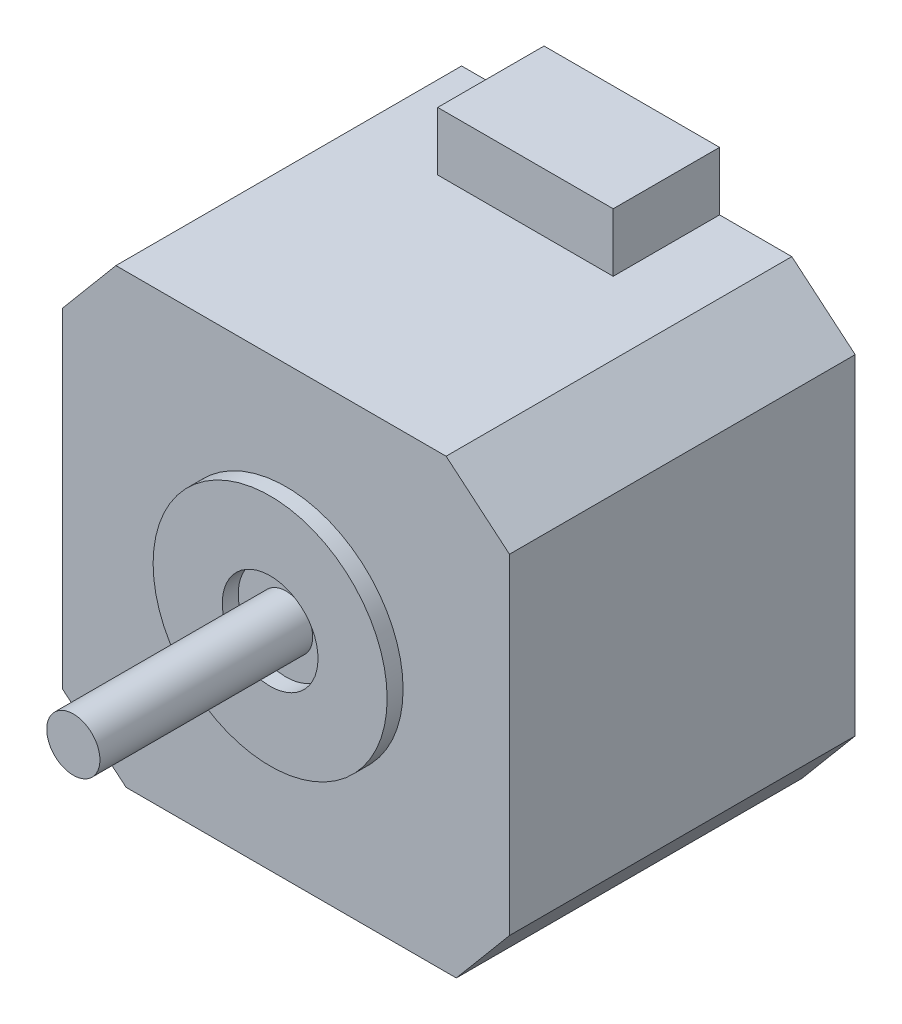
ISO-10303-21;
HEADER;
FILE_DESCRIPTION(('STEP AP214'),'2;1');
FILE_NAME('part.step','',(''),(''),'','','');
FILE_SCHEMA(('AUTOMOTIVE_DESIGN { 1 0 10303 214 1 1 1 1 }'));
ENDSEC;
DATA;
#1=APPLICATION_CONTEXT('core data for automotive mechanical design processes');
#2=APPLICATION_PROTOCOL_DEFINITION('international standard','automotive_design',2000,#1);
#3=PRODUCT_CONTEXT('',#1,'mechanical');
#4=PRODUCT('Part','Part','',(#3));
#5=PRODUCT_RELATED_PRODUCT_CATEGORY('part','',(#4));
#6=PRODUCT_DEFINITION_FORMATION('','',#4);
#7=PRODUCT_DEFINITION_CONTEXT('part definition',#1,'design');
#8=PRODUCT_DEFINITION('design','',#6,#7);
#9=PRODUCT_DEFINITION_SHAPE('','',#8);
#10=(LENGTH_UNIT() NAMED_UNIT(*) SI_UNIT(.MILLI.,.METRE.));
#11=(NAMED_UNIT(*) PLANE_ANGLE_UNIT() SI_UNIT($,.RADIAN.));
#12=(NAMED_UNIT(*) SI_UNIT($,.STERADIAN.) SOLID_ANGLE_UNIT());
#13=UNCERTAINTY_MEASURE_WITH_UNIT(LENGTH_MEASURE(1.E-05),#10,'distance_accuracy_value','');
#14=(GEOMETRIC_REPRESENTATION_CONTEXT(3) GLOBAL_UNCERTAINTY_ASSIGNED_CONTEXT((#13)) GLOBAL_UNIT_ASSIGNED_CONTEXT((#10,
#11,#12)) REPRESENTATION_CONTEXT('',''));
#15=CARTESIAN_POINT('',(0.,0.,0.));
#16=DIRECTION('',(0.,0.,1.));
#17=DIRECTION('',(1.,0.,0.));
#18=AXIS2_PLACEMENT_3D('',#15,#16,#17);
#19=CARTESIAN_POINT('',(-21.,21.,32.5));
#20=DIRECTION('',(0.,-1.,0.));
#21=DIRECTION('',(0.,0.,-1.));
#22=AXIS2_PLACEMENT_3D('',#19,#20,#21);
#23=PLANE('',#22);
#24=DIRECTION('',(0.,0.,1.));
#25=VECTOR('',#24,1.);
#26=CARTESIAN_POINT('',(-8.25,21.,0.));
#27=LINE('',#26,#25);
#28=CARTESIAN_POINT('',(-8.25,21.,0.));
#29=VERTEX_POINT('',#28);
#30=CARTESIAN_POINT('',(-8.25,21.,10.));
#31=VERTEX_POINT('',#30);
#32=EDGE_CURVE('E68',#29,#31,#27,.T.);
#33=ORIENTED_EDGE('',*,*,#32,.F.);
#34=DIRECTION('',(-1.,0.,0.));
#35=VECTOR('',#34,1.);
#36=CARTESIAN_POINT('',(-21.,21.,0.));
#37=LINE('',#36,#35);
#38=CARTESIAN_POINT('',(-16.,21.,0.));
#39=VERTEX_POINT('',#38);
#40=EDGE_CURVE('E194',#29,#39,#37,.T.);
#41=ORIENTED_EDGE('',*,*,#40,.T.);
#42=DIRECTION('',(0.,0.,1.));
#43=VECTOR('',#42,1.);
#44=CARTESIAN_POINT('',(-16.,21.,32.5));
#45=LINE('',#44,#43);
#46=CARTESIAN_POINT('',(-16.,21.,32.5));
#47=VERTEX_POINT('',#46);
#48=EDGE_CURVE('E56',#39,#47,#45,.T.);
#49=ORIENTED_EDGE('',*,*,#48,.T.);
#50=DIRECTION('',(-1.,0.,0.));
#51=VECTOR('',#50,1.);
#52=CARTESIAN_POINT('',(-21.,21.,32.5));
#53=LINE('',#52,#51);
#54=CARTESIAN_POINT('',(15.0412320370289,21.,32.5));
#55=VERTEX_POINT('',#54);
#56=EDGE_CURVE('E181',#55,#47,#53,.T.);
#57=ORIENTED_EDGE('',*,*,#56,.F.);
#58=DIRECTION('',(0.,0.,-1.));
#59=VECTOR('',#58,1.);
#60=CARTESIAN_POINT('',(15.041232037029,21.,32.5));
#61=LINE('',#60,#59);
#62=CARTESIAN_POINT('',(15.0412320370289,21.,0.));
#63=VERTEX_POINT('',#62);
#64=EDGE_CURVE('E233',#55,#63,#61,.T.);
#65=ORIENTED_EDGE('',*,*,#64,.T.);
#66=CARTESIAN_POINT('',(8.24999999999999,21.,0.));
#67=VERTEX_POINT('',#66);
#68=EDGE_CURVE('E195',#63,#67,#37,.T.);
#69=ORIENTED_EDGE('',*,*,#68,.T.);
#70=DIRECTION('',(0.,0.,-1.));
#71=VECTOR('',#70,1.);
#72=CARTESIAN_POINT('',(8.25,21.,10.));
#73=LINE('',#72,#71);
#74=CARTESIAN_POINT('',(8.25,21.,10.));
#75=VERTEX_POINT('',#74);
#76=EDGE_CURVE('E154',#75,#67,#73,.T.);
#77=ORIENTED_EDGE('',*,*,#76,.F.);
#78=DIRECTION('',(1.,0.,0.));
#79=VECTOR('',#78,1.);
#80=CARTESIAN_POINT('',(-8.25,21.,10.));
#81=LINE('',#80,#79);
#82=EDGE_CURVE('E63',#31,#75,#81,.T.);
#83=ORIENTED_EDGE('',*,*,#82,.F.);
#84=EDGE_LOOP('',(#33,#41,#49,#57,#65,#69,#77,#83));
#85=FACE_BOUND('',#84,.T.);
#86=ADVANCED_FACE('F47',(#85),#23,.F.);
#87=CARTESIAN_POINT('',(21.,21.,32.5));
#88=DIRECTION('',(-1.,0.,0.));
#89=DIRECTION('',(0.,0.,1.));
#90=AXIS2_PLACEMENT_3D('',#87,#88,#89);
#91=PLANE('',#90);
#92=DIRECTION('',(0.,1.,0.));
#93=VECTOR('',#92,1.);
#94=CARTESIAN_POINT('',(21.,21.,32.5));
#95=LINE('',#94,#93);
#96=CARTESIAN_POINT('',(21.,-15.0412320370289,32.5));
#97=VERTEX_POINT('',#96);
#98=CARTESIAN_POINT('',(21.,16.,32.5));
#99=VERTEX_POINT('',#98);
#100=EDGE_CURVE('E178',#97,#99,#95,.T.);
#101=ORIENTED_EDGE('',*,*,#100,.F.);
#102=DIRECTION('',(0.,0.,-1.));
#103=VECTOR('',#102,1.);
#104=CARTESIAN_POINT('',(21.,-15.041232037029,32.5));
#105=LINE('',#104,#103);
#106=CARTESIAN_POINT('',(21.,-15.0412320370289,0.));
#107=VERTEX_POINT('',#106);
#108=EDGE_CURVE('E203',#97,#107,#105,.T.);
#109=ORIENTED_EDGE('',*,*,#108,.T.);
#110=DIRECTION('',(0.,1.,0.));
#111=VECTOR('',#110,1.);
#112=CARTESIAN_POINT('',(21.,21.,0.));
#113=LINE('',#112,#111);
#114=CARTESIAN_POINT('',(21.,16.,0.));
#115=VERTEX_POINT('',#114);
#116=EDGE_CURVE('E175',#107,#115,#113,.T.);
#117=ORIENTED_EDGE('',*,*,#116,.T.);
#118=DIRECTION('',(0.,0.,1.));
#119=VECTOR('',#118,1.);
#120=CARTESIAN_POINT('',(21.,16.,32.5));
#121=LINE('',#120,#119);
#122=EDGE_CURVE('E191',#115,#99,#121,.T.);
#123=ORIENTED_EDGE('',*,*,#122,.T.);
#124=EDGE_LOOP('',(#101,#109,#117,#123));
#125=FACE_BOUND('',#124,.T.);
#126=ADVANCED_FACE('F268',(#125),#91,.F.);
#127=CARTESIAN_POINT('',(-21.,21.,32.5));
#128=DIRECTION('',(1.,0.,0.));
#129=DIRECTION('',(0.,1.,0.));
#130=AXIS2_PLACEMENT_3D('',#127,#128,#129);
#131=PLANE('',#130);
#132=DIRECTION('',(0.,-1.,0.));
#133=VECTOR('',#132,1.);
#134=CARTESIAN_POINT('',(-21.,21.,0.));
#135=LINE('',#134,#133);
#136=CARTESIAN_POINT('',(-21.,15.041232037029,0.));
#137=VERTEX_POINT('',#136);
#138=CARTESIAN_POINT('',(-21.,-16.,0.));
#139=VERTEX_POINT('',#138);
#140=EDGE_CURVE('E197',#137,#139,#135,.T.);
#141=ORIENTED_EDGE('',*,*,#140,.T.);
#142=DIRECTION('',(0.,0.,1.));
#143=VECTOR('',#142,1.);
#144=CARTESIAN_POINT('',(-21.,-16.,32.5));
#145=LINE('',#144,#143);
#146=CARTESIAN_POINT('',(-21.,-16.,32.5));
#147=VERTEX_POINT('',#146);
#148=EDGE_CURVE('E231',#139,#147,#145,.T.);
#149=ORIENTED_EDGE('',*,*,#148,.T.);
#150=DIRECTION('',(0.,-1.,0.));
#151=VECTOR('',#150,1.);
#152=CARTESIAN_POINT('',(-21.,21.,32.5));
#153=LINE('',#152,#151);
#154=CARTESIAN_POINT('',(-21.,15.041232037029,32.5));
#155=VERTEX_POINT('',#154);
#156=EDGE_CURVE('E185',#155,#147,#153,.T.);
#157=ORIENTED_EDGE('',*,*,#156,.F.);
#158=DIRECTION('',(0.,0.,-1.));
#159=VECTOR('',#158,1.);
#160=CARTESIAN_POINT('',(-21.,15.041232037029,32.5));
#161=LINE('',#160,#159);
#162=EDGE_CURVE('E228',#155,#137,#161,.T.);
#163=ORIENTED_EDGE('',*,*,#162,.T.);
#164=EDGE_LOOP('',(#141,#149,#157,#163));
#165=FACE_BOUND('',#164,.T.);
#166=ADVANCED_FACE('F248',(#165),#131,.F.);
#167=CARTESIAN_POINT('',(-21.,-21.,32.5));
#168=DIRECTION('',(0.,1.,0.));
#169=DIRECTION('',(0.,0.,1.));
#170=AXIS2_PLACEMENT_3D('',#167,#168,#169);
#171=PLANE('',#170);
#172=DIRECTION('',(1.,0.,0.));
#173=VECTOR('',#172,1.);
#174=CARTESIAN_POINT('',(-21.,-21.,0.));
#175=LINE('',#174,#173);
#176=CARTESIAN_POINT('',(-15.0412320370289,-21.,0.));
#177=VERTEX_POINT('',#176);
#178=CARTESIAN_POINT('',(16.,-21.,0.));
#179=VERTEX_POINT('',#178);
#180=EDGE_CURVE('E182',#177,#179,#175,.T.);
#181=ORIENTED_EDGE('',*,*,#180,.T.);
#182=DIRECTION('',(0.,0.,1.));
#183=VECTOR('',#182,1.);
#184=CARTESIAN_POINT('',(16.,-21.,32.5));
#185=LINE('',#184,#183);
#186=CARTESIAN_POINT('',(16.,-21.,32.5));
#187=VERTEX_POINT('',#186);
#188=EDGE_CURVE('E218',#179,#187,#185,.T.);
#189=ORIENTED_EDGE('',*,*,#188,.T.);
#190=DIRECTION('',(1.,0.,0.));
#191=VECTOR('',#190,1.);
#192=CARTESIAN_POINT('',(-21.,-21.,32.5));
#193=LINE('',#192,#191);
#194=CARTESIAN_POINT('',(-15.0412320370289,-21.,32.5));
#195=VERTEX_POINT('',#194);
#196=EDGE_CURVE('E188',#195,#187,#193,.T.);
#197=ORIENTED_EDGE('',*,*,#196,.F.);
#198=DIRECTION('',(0.,0.,-1.));
#199=VECTOR('',#198,1.);
#200=CARTESIAN_POINT('',(-15.0412320370289,-21.,32.5));
#201=LINE('',#200,#199);
#202=EDGE_CURVE('E215',#195,#177,#201,.T.);
#203=ORIENTED_EDGE('',*,*,#202,.T.);
#204=EDGE_LOOP('',(#181,#189,#197,#203));
#205=FACE_BOUND('',#204,.T.);
#206=ADVANCED_FACE('F260',(#205),#171,.F.);
#207=CARTESIAN_POINT('',(0.,0.,32.5));
#208=DIRECTION('',(0.,0.,1.));
#209=DIRECTION('',(1.,0.,0.));
#210=AXIS2_PLACEMENT_3D('',#207,#208,#209);
#211=PLANE('',#210);
#212=CARTESIAN_POINT('',(0.,0.,32.5));
#213=DIRECTION('',(0.,0.,1.));
#214=DIRECTION('',(1.,0.,0.));
#215=AXIS2_PLACEMENT_3D('',#212,#213,#214);
#216=CIRCLE('',#215,11.);
#217=CARTESIAN_POINT('',(11.,0.,32.5));
#218=VERTEX_POINT('',#217);
#219=EDGE_CURVE('E171',#218,#218,#216,.T.);
#220=ORIENTED_EDGE('',*,*,#219,.F.);
#221=EDGE_LOOP('',(#220));
#222=FACE_BOUND('',#221,.T.);
#223=ORIENTED_EDGE('',*,*,#196,.T.);
#224=DIRECTION('',(-0.64278760968654,-0.766044443118977,0.));
#225=VECTOR('',#224,1.);
#226=CARTESIAN_POINT('',(19.7296668279636,-16.5551561585949,32.5));
#227=LINE('',#226,#225);
#228=EDGE_CURVE('E226',#187,#97,#227,.F.);
#229=ORIENTED_EDGE('',*,*,#228,.T.);
#230=ORIENTED_EDGE('',*,*,#100,.T.);
#231=DIRECTION('',(0.766044443118977,-0.64278760968654,0.));
#232=VECTOR('',#231,1.);
#233=CARTESIAN_POINT('',(16.5551561585949,19.7296668279636,32.5));
#234=LINE('',#233,#232);
#235=EDGE_CURVE('E220',#99,#55,#234,.F.);
#236=ORIENTED_EDGE('',*,*,#235,.T.);
#237=ORIENTED_EDGE('',*,*,#56,.T.);
#238=DIRECTION('',(0.64278760968654,0.766044443118977,0.));
#239=VECTOR('',#238,1.);
#240=CARTESIAN_POINT('',(-19.7296668279636,16.5551561585949,32.5));
#241=LINE('',#240,#239);
#242=EDGE_CURVE('E222',#47,#155,#241,.F.);
#243=ORIENTED_EDGE('',*,*,#242,.T.);
#244=ORIENTED_EDGE('',*,*,#156,.T.);
#245=DIRECTION('',(-0.766044443118977,0.64278760968654,0.));
#246=VECTOR('',#245,1.);
#247=CARTESIAN_POINT('',(-16.5551561585949,-19.7296668279636,32.5));
#248=LINE('',#247,#246);
#249=EDGE_CURVE('E224',#147,#195,#248,.F.);
#250=ORIENTED_EDGE('',*,*,#249,.T.);
#251=EDGE_LOOP('',(#223,#229,#230,#236,#237,#243,#244,#250));
#252=FACE_BOUND('',#251,.T.);
#253=ADVANCED_FACE('F241',(#222,#252),#211,.T.);
#254=CARTESIAN_POINT('',(0.,0.,0.));
#255=DIRECTION('',(0.,0.,1.));
#256=DIRECTION('',(1.,0.,0.));
#257=AXIS2_PLACEMENT_3D('',#254,#255,#256);
#258=PLANE('',#257);
#259=ORIENTED_EDGE('',*,*,#116,.F.);
#260=DIRECTION('',(0.64278760968654,0.766044443118977,0.));
#261=VECTOR('',#260,1.);
#262=CARTESIAN_POINT('',(21.,-15.041232037029,0.));
#263=LINE('',#262,#261);
#264=EDGE_CURVE('E213',#107,#179,#263,.F.);
#265=ORIENTED_EDGE('',*,*,#264,.T.);
#266=ORIENTED_EDGE('',*,*,#180,.F.);
#267=DIRECTION('',(0.766044443118977,-0.64278760968654,0.));
#268=VECTOR('',#267,1.);
#269=CARTESIAN_POINT('',(-15.0412320370289,-21.,0.));
#270=LINE('',#269,#268);
#271=EDGE_CURVE('E211',#177,#139,#270,.F.);
#272=ORIENTED_EDGE('',*,*,#271,.T.);
#273=ORIENTED_EDGE('',*,*,#140,.F.);
#274=DIRECTION('',(-0.64278760968654,-0.766044443118977,0.));
#275=VECTOR('',#274,1.);
#276=CARTESIAN_POINT('',(-21.,15.041232037029,0.));
#277=LINE('',#276,#275);
#278=EDGE_CURVE('E208',#137,#39,#277,.F.);
#279=ORIENTED_EDGE('',*,*,#278,.T.);
#280=ORIENTED_EDGE('',*,*,#40,.F.);
#281=DIRECTION('',(0.,-1.,0.));
#282=VECTOR('',#281,1.);
#283=CARTESIAN_POINT('',(-8.25,26.5,0.));
#284=LINE('',#283,#282);
#285=CARTESIAN_POINT('',(-8.25,26.5,0.));
#286=VERTEX_POINT('',#285);
#287=EDGE_CURVE('E276',#286,#29,#284,.T.);
#288=ORIENTED_EDGE('',*,*,#287,.F.);
#289=DIRECTION('',(1.,0.,0.));
#290=VECTOR('',#289,1.);
#291=CARTESIAN_POINT('',(0.,26.5,0.));
#292=LINE('',#291,#290);
#293=CARTESIAN_POINT('',(8.25,26.5,0.));
#294=VERTEX_POINT('',#293);
#295=EDGE_CURVE('E150',#286,#294,#292,.T.);
#296=ORIENTED_EDGE('',*,*,#295,.T.);
#297=DIRECTION('',(0.,-1.,0.));
#298=VECTOR('',#297,1.);
#299=CARTESIAN_POINT('',(8.25,26.5,0.));
#300=LINE('',#299,#298);
#301=EDGE_CURVE('E162',#294,#67,#300,.T.);
#302=ORIENTED_EDGE('',*,*,#301,.T.);
#303=ORIENTED_EDGE('',*,*,#68,.F.);
#304=DIRECTION('',(-0.766044443118977,0.64278760968654,0.));
#305=VECTOR('',#304,1.);
#306=CARTESIAN_POINT('',(15.041232037029,21.,0.));
#307=LINE('',#306,#305);
#308=EDGE_CURVE('E206',#63,#115,#307,.F.);
#309=ORIENTED_EDGE('',*,*,#308,.T.);
#310=EDGE_LOOP('',(#259,#265,#266,#272,#273,#279,#280,#288,#296,#302,#303,#309));
#311=FACE_BOUND('',#310,.T.);
#312=ADVANCED_FACE('F252',(#311),#258,.F.);
#313=CARTESIAN_POINT('',(21.,-15.041232037029,32.5));
#314=DIRECTION('',(-0.766044443118977,0.64278760968654,0.));
#315=DIRECTION('',(0.,0.,-1.));
#316=AXIS2_PLACEMENT_3D('',#313,#314,#315);
#317=PLANE('',#316);
#318=ORIENTED_EDGE('',*,*,#228,.F.);
#319=ORIENTED_EDGE('',*,*,#188,.F.);
#320=ORIENTED_EDGE('',*,*,#264,.F.);
#321=ORIENTED_EDGE('',*,*,#108,.F.);
#322=EDGE_LOOP('',(#318,#319,#320,#321));
#323=FACE_BOUND('',#322,.T.);
#324=ADVANCED_FACE('F266',(#323),#317,.F.);
#325=CARTESIAN_POINT('',(-15.0412320370289,-21.,32.5));
#326=DIRECTION('',(0.64278760968654,0.766044443118977,0.));
#327=DIRECTION('',(0.,0.,-1.));
#328=AXIS2_PLACEMENT_3D('',#325,#326,#327);
#329=PLANE('',#328);
#330=ORIENTED_EDGE('',*,*,#249,.F.);
#331=ORIENTED_EDGE('',*,*,#148,.F.);
#332=ORIENTED_EDGE('',*,*,#271,.F.);
#333=ORIENTED_EDGE('',*,*,#202,.F.);
#334=EDGE_LOOP('',(#330,#331,#332,#333));
#335=FACE_BOUND('',#334,.T.);
#336=ADVANCED_FACE('F257',(#335),#329,.F.);
#337=CARTESIAN_POINT('',(-21.,15.041232037029,32.5));
#338=DIRECTION('',(0.766044443118977,-0.64278760968654,0.));
#339=DIRECTION('',(0.,0.,-1.));
#340=AXIS2_PLACEMENT_3D('',#337,#338,#339);
#341=PLANE('',#340);
#342=ORIENTED_EDGE('',*,*,#242,.F.);
#343=ORIENTED_EDGE('',*,*,#48,.F.);
#344=ORIENTED_EDGE('',*,*,#278,.F.);
#345=ORIENTED_EDGE('',*,*,#162,.F.);
#346=EDGE_LOOP('',(#342,#343,#344,#345));
#347=FACE_BOUND('',#346,.T.);
#348=ADVANCED_FACE('F245',(#347),#341,.F.);
#349=CARTESIAN_POINT('',(15.041232037029,21.,32.5));
#350=DIRECTION('',(-0.64278760968654,-0.766044443118977,0.));
#351=DIRECTION('',(0.,0.,-1.));
#352=AXIS2_PLACEMENT_3D('',#349,#350,#351);
#353=PLANE('',#352);
#354=ORIENTED_EDGE('',*,*,#235,.F.);
#355=ORIENTED_EDGE('',*,*,#122,.F.);
#356=ORIENTED_EDGE('',*,*,#308,.F.);
#357=ORIENTED_EDGE('',*,*,#64,.F.);
#358=EDGE_LOOP('',(#354,#355,#356,#357));
#359=FACE_BOUND('',#358,.T.);
#360=ADVANCED_FACE('F50',(#359),#353,.F.);
#361=CARTESIAN_POINT('',(0.,0.,34.));
#362=DIRECTION('',(0.,0.,1.));
#363=DIRECTION('',(1.,0.,0.));
#364=AXIS2_PLACEMENT_3D('',#361,#362,#363);
#365=PLANE('',#364);
#366=CARTESIAN_POINT('',(0.,0.,34.));
#367=DIRECTION('',(0.,0.,1.));
#368=DIRECTION('',(1.,0.,0.));
#369=AXIS2_PLACEMENT_3D('',#366,#367,#368);
#370=CIRCLE('',#369,11.);
#371=CARTESIAN_POINT('',(11.,0.,34.));
#372=VERTEX_POINT('',#371);
#373=EDGE_CURVE('E172',#372,#372,#370,.T.);
#374=ORIENTED_EDGE('',*,*,#373,.T.);
#375=EDGE_LOOP('',(#374));
#376=FACE_BOUND('',#375,.T.);
#377=CARTESIAN_POINT('',(0.,0.,34.));
#378=DIRECTION('',(0.,0.,1.));
#379=DIRECTION('',(1.,0.,0.));
#380=AXIS2_PLACEMENT_3D('',#377,#378,#379);
#381=CIRCLE('',#380,4.5);
#382=CARTESIAN_POINT('',(4.5,0.,34.));
#383=VERTEX_POINT('',#382);
#384=EDGE_CURVE('E167',#383,#383,#381,.T.);
#385=ORIENTED_EDGE('',*,*,#384,.F.);
#386=EDGE_LOOP('',(#385));
#387=FACE_BOUND('',#386,.T.);
#388=ADVANCED_FACE('F317',(#376,#387),#365,.T.);
#389=CARTESIAN_POINT('',(0.,0.,34.));
#390=DIRECTION('',(0.,0.,-1.));
#391=DIRECTION('',(-1.,0.,0.));
#392=AXIS2_PLACEMENT_3D('',#389,#390,#391);
#393=CYLINDRICAL_SURFACE('',#392,11.);
#394=ORIENTED_EDGE('',*,*,#373,.F.);
#395=EDGE_LOOP('',(#394));
#396=FACE_BOUND('',#395,.T.);
#397=ORIENTED_EDGE('',*,*,#219,.T.);
#398=EDGE_LOOP('',(#397));
#399=FACE_BOUND('',#398,.T.);
#400=ADVANCED_FACE('F321',(#396,#399),#393,.T.);
#401=CARTESIAN_POINT('',(0.,0.,34.));
#402=DIRECTION('',(0.,0.,-1.));
#403=DIRECTION('',(-1.,0.,0.));
#404=AXIS2_PLACEMENT_3D('',#401,#402,#403);
#405=CYLINDRICAL_SURFACE('',#404,4.5);
#406=ORIENTED_EDGE('',*,*,#384,.T.);
#407=EDGE_LOOP('',(#406));
#408=FACE_BOUND('',#407,.T.);
#409=CARTESIAN_POINT('',(0.,0.,32.5));
#410=DIRECTION('',(0.,0.,1.));
#411=DIRECTION('',(1.,0.,0.));
#412=AXIS2_PLACEMENT_3D('',#409,#410,#411);
#413=CIRCLE('',#412,4.5);
#414=CARTESIAN_POINT('',(4.5,0.,32.5));
#415=VERTEX_POINT('',#414);
#416=EDGE_CURVE('E12',#415,#415,#413,.F.);
#417=ORIENTED_EDGE('',*,*,#416,.T.);
#418=EDGE_LOOP('',(#417));
#419=FACE_BOUND('',#418,.T.);
#420=ADVANCED_FACE('F327',(#408,#419),#405,.F.);
#421=CARTESIAN_POINT('',(0.,0.,32.5));
#422=DIRECTION('',(0.,0.,1.));
#423=DIRECTION('',(1.,0.,0.));
#424=AXIS2_PLACEMENT_3D('',#421,#422,#423);
#425=CIRCLE('',#424,2.5);
#426=CARTESIAN_POINT('',(2.5,0.,32.5));
#427=VERTEX_POINT('',#426);
#428=EDGE_CURVE('E157',#427,#427,#425,.T.);
#429=ORIENTED_EDGE('',*,*,#428,.F.);
#430=EDGE_LOOP('',(#429));
#431=FACE_BOUND('',#430,.T.);
#432=ORIENTED_EDGE('',*,*,#416,.F.);
#433=EDGE_LOOP('',(#432));
#434=FACE_BOUND('',#433,.T.);
#435=ADVANCED_FACE('F337',(#431,#434),#211,.T.);
#436=CARTESIAN_POINT('',(0.,0.,52.5));
#437=DIRECTION('',(0.,0.,-1.));
#438=DIRECTION('',(-1.,0.,0.));
#439=AXIS2_PLACEMENT_3D('',#436,#437,#438);
#440=CYLINDRICAL_SURFACE('',#439,2.5);
#441=CARTESIAN_POINT('',(0.,0.,52.5));
#442=DIRECTION('',(0.,0.,1.));
#443=DIRECTION('',(1.,0.,0.));
#444=AXIS2_PLACEMENT_3D('',#441,#442,#443);
#445=CIRCLE('',#444,2.5);
#446=CARTESIAN_POINT('',(2.5,0.,52.5));
#447=VERTEX_POINT('',#446);
#448=EDGE_CURVE('E160',#447,#447,#445,.T.);
#449=ORIENTED_EDGE('',*,*,#448,.F.);
#450=EDGE_LOOP('',(#449));
#451=FACE_BOUND('',#450,.T.);
#452=ORIENTED_EDGE('',*,*,#428,.T.);
#453=EDGE_LOOP('',(#452));
#454=FACE_BOUND('',#453,.T.);
#455=ADVANCED_FACE('F419',(#451,#454),#440,.T.);
#456=CARTESIAN_POINT('',(0.,0.,52.5));
#457=DIRECTION('',(0.,0.,1.));
#458=DIRECTION('',(1.,0.,0.));
#459=AXIS2_PLACEMENT_3D('',#456,#457,#458);
#460=PLANE('',#459);
#461=ORIENTED_EDGE('',*,*,#448,.T.);
#462=EDGE_LOOP('',(#461));
#463=FACE_BOUND('',#462,.T.);
#464=ADVANCED_FACE('F363',(#463),#460,.T.);
#465=CARTESIAN_POINT('',(-8.25,26.5,0.));
#466=DIRECTION('',(1.,0.,0.));
#467=DIRECTION('',(0.,0.,-1.));
#468=AXIS2_PLACEMENT_3D('',#465,#466,#467);
#469=PLANE('',#468);
#470=ORIENTED_EDGE('',*,*,#32,.T.);
#471=DIRECTION('',(0.,-1.,0.));
#472=VECTOR('',#471,1.);
#473=CARTESIAN_POINT('',(-8.25,26.5,10.));
#474=LINE('',#473,#472);
#475=CARTESIAN_POINT('',(-8.25,26.5,10.));
#476=VERTEX_POINT('',#475);
#477=EDGE_CURVE('E139',#476,#31,#474,.T.);
#478=ORIENTED_EDGE('',*,*,#477,.F.);
#479=DIRECTION('',(0.,0.,1.));
#480=VECTOR('',#479,1.);
#481=CARTESIAN_POINT('',(-8.25,26.5,0.));
#482=LINE('',#481,#480);
#483=EDGE_CURVE('E145',#286,#476,#482,.T.);
#484=ORIENTED_EDGE('',*,*,#483,.F.);
#485=ORIENTED_EDGE('',*,*,#287,.T.);
#486=EDGE_LOOP('',(#470,#478,#484,#485));
#487=FACE_BOUND('',#486,.T.);
#488=ADVANCED_FACE('F156',(#487),#469,.F.);
#489=CARTESIAN_POINT('',(-8.25,26.5,10.));
#490=DIRECTION('',(0.,0.,-1.));
#491=DIRECTION('',(-1.,0.,0.));
#492=AXIS2_PLACEMENT_3D('',#489,#490,#491);
#493=PLANE('',#492);
#494=ORIENTED_EDGE('',*,*,#82,.T.);
#495=DIRECTION('',(0.,-1.,0.));
#496=VECTOR('',#495,1.);
#497=CARTESIAN_POINT('',(8.25,26.5,10.));
#498=LINE('',#497,#496);
#499=CARTESIAN_POINT('',(8.25,26.5,10.));
#500=VERTEX_POINT('',#499);
#501=EDGE_CURVE('E141',#500,#75,#498,.T.);
#502=ORIENTED_EDGE('',*,*,#501,.F.);
#503=DIRECTION('',(1.,0.,0.));
#504=VECTOR('',#503,1.);
#505=CARTESIAN_POINT('',(-8.25,26.5,10.));
#506=LINE('',#505,#504);
#507=EDGE_CURVE('E135',#476,#500,#506,.T.);
#508=ORIENTED_EDGE('',*,*,#507,.F.);
#509=ORIENTED_EDGE('',*,*,#477,.T.);
#510=EDGE_LOOP('',(#494,#502,#508,#509));
#511=FACE_BOUND('',#510,.T.);
#512=ADVANCED_FACE('F137',(#511),#493,.F.);
#513=CARTESIAN_POINT('',(8.25,26.5,10.));
#514=DIRECTION('',(-1.,0.,0.));
#515=DIRECTION('',(0.,0.,1.));
#516=AXIS2_PLACEMENT_3D('',#513,#514,#515);
#517=PLANE('',#516);
#518=ORIENTED_EDGE('',*,*,#76,.T.);
#519=ORIENTED_EDGE('',*,*,#301,.F.);
#520=DIRECTION('',(0.,0.,-1.));
#521=VECTOR('',#520,1.);
#522=CARTESIAN_POINT('',(8.25,26.5,10.));
#523=LINE('',#522,#521);
#524=EDGE_CURVE('E144',#500,#294,#523,.T.);
#525=ORIENTED_EDGE('',*,*,#524,.F.);
#526=ORIENTED_EDGE('',*,*,#501,.T.);
#527=EDGE_LOOP('',(#518,#519,#525,#526));
#528=FACE_BOUND('',#527,.T.);
#529=ADVANCED_FACE('F277',(#528),#517,.F.);
#530=CARTESIAN_POINT('',(0.,26.5,0.));
#531=DIRECTION('',(0.,1.,0.));
#532=DIRECTION('',(0.,0.,1.));
#533=AXIS2_PLACEMENT_3D('',#530,#531,#532);
#534=PLANE('',#533);
#535=ORIENTED_EDGE('',*,*,#483,.T.);
#536=ORIENTED_EDGE('',*,*,#507,.T.);
#537=ORIENTED_EDGE('',*,*,#524,.T.);
#538=ORIENTED_EDGE('',*,*,#295,.F.);
#539=EDGE_LOOP('',(#535,#536,#537,#538));
#540=FACE_BOUND('',#539,.T.);
#541=ADVANCED_FACE('F148',(#540),#534,.T.);
#542=CLOSED_SHELL('',(#86,#126,#166,#206,#253,#312,#324,#336,#348,#360,#388,#400,#420,#435,#455,
#464,#488,#512,#529,#541));
#543=MANIFOLD_SOLID_BREP('B2',#542);
#544=ADVANCED_BREP_SHAPE_REPRESENTATION('',(#18,#543),#14);
#545=SHAPE_DEFINITION_REPRESENTATION(#9,#544);
ENDSEC;
END-ISO-10303-21;
